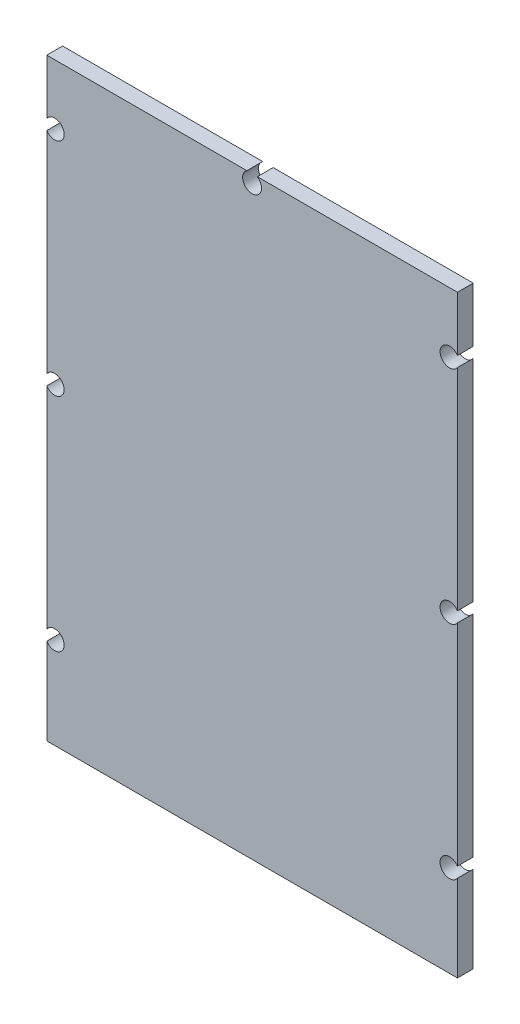
ISO-10303-21;
HEADER;
FILE_DESCRIPTION(('STEP AP214'),'2;1');
FILE_NAME('part.step','',(''),(''),'','','');
FILE_SCHEMA(('AUTOMOTIVE_DESIGN { 1 0 10303 214 1 1 1 1 }'));
ENDSEC;
DATA;
#1=APPLICATION_CONTEXT('core data for automotive mechanical design processes');
#2=APPLICATION_PROTOCOL_DEFINITION('international standard','automotive_design',2000,#1);
#3=PRODUCT_CONTEXT('',#1,'mechanical');
#4=PRODUCT('Part','Part','',(#3));
#5=PRODUCT_RELATED_PRODUCT_CATEGORY('part','',(#4));
#6=PRODUCT_DEFINITION_FORMATION('','',#4);
#7=PRODUCT_DEFINITION_CONTEXT('part definition',#1,'design');
#8=PRODUCT_DEFINITION('design','',#6,#7);
#9=PRODUCT_DEFINITION_SHAPE('','',#8);
#10=(LENGTH_UNIT() NAMED_UNIT(*) SI_UNIT(.MILLI.,.METRE.));
#11=(NAMED_UNIT(*) PLANE_ANGLE_UNIT() SI_UNIT($,.RADIAN.));
#12=(NAMED_UNIT(*) SI_UNIT($,.STERADIAN.) SOLID_ANGLE_UNIT());
#13=UNCERTAINTY_MEASURE_WITH_UNIT(LENGTH_MEASURE(1.E-05),#10,'distance_accuracy_value','');
#14=(GEOMETRIC_REPRESENTATION_CONTEXT(3) GLOBAL_UNCERTAINTY_ASSIGNED_CONTEXT((#13)) GLOBAL_UNIT_ASSIGNED_CONTEXT((#10,
#11,#12)) REPRESENTATION_CONTEXT('',''));
#15=CARTESIAN_POINT('',(0.,0.,0.));
#16=DIRECTION('',(0.,0.,1.));
#17=DIRECTION('',(1.,0.,0.));
#18=AXIS2_PLACEMENT_3D('',#15,#16,#17);
#19=CARTESIAN_POINT('',(-32.5,47.,2.5));
#20=DIRECTION('',(0.,-1.,0.));
#21=DIRECTION('',(0.,0.,-1.));
#22=AXIS2_PLACEMENT_3D('',#19,#20,#21);
#23=PLANE('',#22);
#24=DIRECTION('',(0.,0.,-1.));
#25=VECTOR('',#24,1.);
#26=CARTESIAN_POINT('',(-0.82915619758885,47.,2.5));
#27=LINE('',#26,#25);
#28=CARTESIAN_POINT('',(-0.82915619758885,47.,0.));
#29=VERTEX_POINT('',#28);
#30=CARTESIAN_POINT('',(-0.82915619758885,47.,2.5));
#31=VERTEX_POINT('',#30);
#32=EDGE_CURVE('E160',#29,#31,#27,.F.);
#33=ORIENTED_EDGE('',*,*,#32,.F.);
#34=DIRECTION('',(-1.,0.,0.));
#35=VECTOR('',#34,1.);
#36=CARTESIAN_POINT('',(-32.5,47.,0.));
#37=LINE('',#36,#35);
#38=CARTESIAN_POINT('',(-32.5,47.,0.));
#39=VERTEX_POINT('',#38);
#40=EDGE_CURVE('E200',#29,#39,#37,.T.);
#41=ORIENTED_EDGE('',*,*,#40,.T.);
#42=DIRECTION('',(0.,0.,-1.));
#43=VECTOR('',#42,1.);
#44=CARTESIAN_POINT('',(-32.5,47.,2.5));
#45=LINE('',#44,#43);
#46=CARTESIAN_POINT('',(-32.5,47.,2.5));
#47=VERTEX_POINT('',#46);
#48=EDGE_CURVE('E179',#47,#39,#45,.T.);
#49=ORIENTED_EDGE('',*,*,#48,.F.);
#50=DIRECTION('',(-1.,0.,0.));
#51=VECTOR('',#50,1.);
#52=CARTESIAN_POINT('',(-32.5,47.,2.5));
#53=LINE('',#52,#51);
#54=EDGE_CURVE('E180',#31,#47,#53,.T.);
#55=ORIENTED_EDGE('',*,*,#54,.F.);
#56=EDGE_LOOP('',(#33,#41,#49,#55));
#57=FACE_BOUND('',#56,.T.);
#58=ADVANCED_FACE('F35',(#57),#23,.F.);
#59=DIRECTION('',(0.,0.,-1.));
#60=VECTOR('',#59,1.);
#61=CARTESIAN_POINT('',(0.82915619758885,47.,2.5));
#62=LINE('',#61,#60);
#63=CARTESIAN_POINT('',(0.82915619758885,47.,2.5));
#64=VERTEX_POINT('',#63);
#65=CARTESIAN_POINT('',(0.82915619758885,47.,0.));
#66=VERTEX_POINT('',#65);
#67=EDGE_CURVE('E49',#64,#66,#62,.T.);
#68=ORIENTED_EDGE('',*,*,#67,.F.);
#69=CARTESIAN_POINT('',(32.5,47.,2.5));
#70=VERTEX_POINT('',#69);
#71=EDGE_CURVE('E170',#70,#64,#53,.T.);
#72=ORIENTED_EDGE('',*,*,#71,.F.);
#73=DIRECTION('',(0.,0.,-1.));
#74=VECTOR('',#73,1.);
#75=CARTESIAN_POINT('',(32.5,47.,2.5));
#76=LINE('',#75,#74);
#77=CARTESIAN_POINT('',(32.5,47.,0.));
#78=VERTEX_POINT('',#77);
#79=EDGE_CURVE('E183',#70,#78,#76,.T.);
#80=ORIENTED_EDGE('',*,*,#79,.T.);
#81=EDGE_CURVE('E172',#78,#66,#37,.T.);
#82=ORIENTED_EDGE('',*,*,#81,.T.);
#83=EDGE_LOOP('',(#68,#72,#80,#82));
#84=FACE_BOUND('',#83,.T.);
#85=ADVANCED_FACE('F168',(#84),#23,.F.);
#86=CARTESIAN_POINT('',(-32.5,47.,2.5));
#87=DIRECTION('',(1.,0.,0.));
#88=DIRECTION('',(0.,1.,0.));
#89=AXIS2_PLACEMENT_3D('',#86,#87,#88);
#90=PLANE('',#89);
#91=DIRECTION('',(0.,0.,-1.));
#92=VECTOR('',#91,1.);
#93=CARTESIAN_POINT('',(-32.5,-33.3291561975889,2.5));
#94=LINE('',#93,#92);
#95=CARTESIAN_POINT('',(-32.5,-33.3291561975889,0.));
#96=VERTEX_POINT('',#95);
#97=CARTESIAN_POINT('',(-32.5,-33.3291561975889,2.5));
#98=VERTEX_POINT('',#97);
#99=EDGE_CURVE('E271',#96,#98,#94,.F.);
#100=ORIENTED_EDGE('',*,*,#99,.F.);
#101=DIRECTION('',(0.,-1.,0.));
#102=VECTOR('',#101,1.);
#103=CARTESIAN_POINT('',(-32.5,47.,0.));
#104=LINE('',#103,#102);
#105=CARTESIAN_POINT('',(-32.5,-47.,0.));
#106=VERTEX_POINT('',#105);
#107=EDGE_CURVE('E194',#96,#106,#104,.T.);
#108=ORIENTED_EDGE('',*,*,#107,.T.);
#109=DIRECTION('',(0.,0.,-1.));
#110=VECTOR('',#109,1.);
#111=CARTESIAN_POINT('',(-32.5,-47.,2.5));
#112=LINE('',#111,#110);
#113=CARTESIAN_POINT('',(-32.5,-47.,2.5));
#114=VERTEX_POINT('',#113);
#115=EDGE_CURVE('E209',#114,#106,#112,.T.);
#116=ORIENTED_EDGE('',*,*,#115,.F.);
#117=DIRECTION('',(0.,-1.,0.));
#118=VECTOR('',#117,1.);
#119=CARTESIAN_POINT('',(-32.5,47.,2.5));
#120=LINE('',#119,#118);
#121=EDGE_CURVE('E203',#98,#114,#120,.T.);
#122=ORIENTED_EDGE('',*,*,#121,.F.);
#123=EDGE_LOOP('',(#100,#108,#116,#122));
#124=FACE_BOUND('',#123,.T.);
#125=ADVANCED_FACE('F37',(#124),#90,.F.);
#126=DIRECTION('',(0.,0.,-1.));
#127=VECTOR('',#126,1.);
#128=CARTESIAN_POINT('',(-32.5,-31.6708438024111,2.5));
#129=LINE('',#128,#127);
#130=CARTESIAN_POINT('',(-32.5,-31.6708438024111,2.5));
#131=VERTEX_POINT('',#130);
#132=CARTESIAN_POINT('',(-32.5,-31.6708438024111,0.));
#133=VERTEX_POINT('',#132);
#134=EDGE_CURVE('E57',#131,#133,#129,.T.);
#135=ORIENTED_EDGE('',*,*,#134,.F.);
#136=CARTESIAN_POINT('',(-32.5,1.67084380241114,2.5));
#137=VERTEX_POINT('',#136);
#138=EDGE_CURVE('E334',#137,#131,#120,.T.);
#139=ORIENTED_EDGE('',*,*,#138,.F.);
#140=DIRECTION('',(0.,0.,-1.));
#141=VECTOR('',#140,1.);
#142=CARTESIAN_POINT('',(-32.5,1.67084380241115,2.5));
#143=LINE('',#142,#141);
#144=CARTESIAN_POINT('',(-32.5,1.67084380241114,0.));
#145=VERTEX_POINT('',#144);
#146=EDGE_CURVE('E264',#145,#137,#143,.F.);
#147=ORIENTED_EDGE('',*,*,#146,.F.);
#148=EDGE_CURVE('E315',#145,#133,#104,.T.);
#149=ORIENTED_EDGE('',*,*,#148,.T.);
#150=EDGE_LOOP('',(#135,#139,#147,#149));
#151=FACE_BOUND('',#150,.T.);
#152=ADVANCED_FACE('F332',(#151),#90,.F.);
#153=DIRECTION('',(0.,0.,-1.));
#154=VECTOR('',#153,1.);
#155=CARTESIAN_POINT('',(-32.5,3.32915619758885,2.5));
#156=LINE('',#155,#154);
#157=CARTESIAN_POINT('',(-32.5,3.32915619758885,2.5));
#158=VERTEX_POINT('',#157);
#159=CARTESIAN_POINT('',(-32.5,3.32915619758885,0.));
#160=VERTEX_POINT('',#159);
#161=EDGE_CURVE('E262',#158,#160,#156,.T.);
#162=ORIENTED_EDGE('',*,*,#161,.F.);
#163=CARTESIAN_POINT('',(-32.5,36.6708438024111,2.5));
#164=VERTEX_POINT('',#163);
#165=EDGE_CURVE('E288',#164,#158,#120,.T.);
#166=ORIENTED_EDGE('',*,*,#165,.F.);
#167=DIRECTION('',(0.,0.,-1.));
#168=VECTOR('',#167,1.);
#169=CARTESIAN_POINT('',(-32.5,36.6708438024111,2.5));
#170=LINE('',#169,#168);
#171=CARTESIAN_POINT('',(-32.5,36.6708438024111,0.));
#172=VERTEX_POINT('',#171);
#173=EDGE_CURVE('E283',#172,#164,#170,.F.);
#174=ORIENTED_EDGE('',*,*,#173,.F.);
#175=EDGE_CURVE('E193',#172,#160,#104,.T.);
#176=ORIENTED_EDGE('',*,*,#175,.T.);
#177=EDGE_LOOP('',(#162,#166,#174,#176));
#178=FACE_BOUND('',#177,.T.);
#179=ADVANCED_FACE('F323',(#178),#90,.F.);
#180=CARTESIAN_POINT('',(32.5,47.,2.5));
#181=DIRECTION('',(-1.,0.,0.));
#182=DIRECTION('',(0.,0.,1.));
#183=AXIS2_PLACEMENT_3D('',#180,#181,#182);
#184=PLANE('',#183);
#185=DIRECTION('',(0.,0.,-1.));
#186=VECTOR('',#185,1.);
#187=CARTESIAN_POINT('',(32.5,3.32915619758886,2.5));
#188=LINE('',#187,#186);
#189=CARTESIAN_POINT('',(32.5,3.32915619758886,0.));
#190=VERTEX_POINT('',#189);
#191=CARTESIAN_POINT('',(32.5,3.32915619758886,2.5));
#192=VERTEX_POINT('',#191);
#193=EDGE_CURVE('E225',#190,#192,#188,.F.);
#194=ORIENTED_EDGE('',*,*,#193,.F.);
#195=DIRECTION('',(0.,1.,0.));
#196=VECTOR('',#195,1.);
#197=CARTESIAN_POINT('',(32.5,47.,0.));
#198=LINE('',#197,#196);
#199=CARTESIAN_POINT('',(32.5,36.6708438024112,0.));
#200=VERTEX_POINT('',#199);
#201=EDGE_CURVE('E202',#190,#200,#198,.T.);
#202=ORIENTED_EDGE('',*,*,#201,.T.);
#203=DIRECTION('',(0.,0.,-1.));
#204=VECTOR('',#203,1.);
#205=CARTESIAN_POINT('',(32.5,36.6708438024112,2.5));
#206=LINE('',#205,#204);
#207=CARTESIAN_POINT('',(32.5,36.6708438024112,2.5));
#208=VERTEX_POINT('',#207);
#209=EDGE_CURVE('E276',#208,#200,#206,.T.);
#210=ORIENTED_EDGE('',*,*,#209,.F.);
#211=DIRECTION('',(0.,1.,0.));
#212=VECTOR('',#211,1.);
#213=CARTESIAN_POINT('',(32.5,47.,2.5));
#214=LINE('',#213,#212);
#215=EDGE_CURVE('E238',#192,#208,#214,.T.);
#216=ORIENTED_EDGE('',*,*,#215,.F.);
#217=EDGE_LOOP('',(#194,#202,#210,#216));
#218=FACE_BOUND('',#217,.T.);
#219=ADVANCED_FACE('F235',(#218),#184,.F.);
#220=DIRECTION('',(0.,0.,-1.));
#221=VECTOR('',#220,1.);
#222=CARTESIAN_POINT('',(32.5,1.67084380241115,2.5));
#223=LINE('',#222,#221);
#224=CARTESIAN_POINT('',(32.5,1.67084380241115,2.5));
#225=VERTEX_POINT('',#224);
#226=CARTESIAN_POINT('',(32.5,1.67084380241115,0.));
#227=VERTEX_POINT('',#226);
#228=EDGE_CURVE('E228',#225,#227,#223,.T.);
#229=ORIENTED_EDGE('',*,*,#228,.F.);
#230=CARTESIAN_POINT('',(32.5,-31.6708438024111,2.5));
#231=VERTEX_POINT('',#230);
#232=EDGE_CURVE('E292',#231,#225,#214,.T.);
#233=ORIENTED_EDGE('',*,*,#232,.F.);
#234=DIRECTION('',(0.,0.,-1.));
#235=VECTOR('',#234,1.);
#236=CARTESIAN_POINT('',(32.5,-31.6708438024111,2.5));
#237=LINE('',#236,#235);
#238=CARTESIAN_POINT('',(32.5,-31.6708438024111,0.));
#239=VERTEX_POINT('',#238);
#240=EDGE_CURVE('E268',#239,#231,#237,.F.);
#241=ORIENTED_EDGE('',*,*,#240,.F.);
#242=EDGE_CURVE('E201',#239,#227,#198,.T.);
#243=ORIENTED_EDGE('',*,*,#242,.T.);
#244=EDGE_LOOP('',(#229,#233,#241,#243));
#245=FACE_BOUND('',#244,.T.);
#246=ADVANCED_FACE('F298',(#245),#184,.F.);
#247=DIRECTION('',(0.,0.,-1.));
#248=VECTOR('',#247,1.);
#249=CARTESIAN_POINT('',(32.5,-33.3291561975889,2.5));
#250=LINE('',#249,#248);
#251=CARTESIAN_POINT('',(32.5,-33.3291561975889,2.5));
#252=VERTEX_POINT('',#251);
#253=CARTESIAN_POINT('',(32.5,-33.3291561975889,0.));
#254=VERTEX_POINT('',#253);
#255=EDGE_CURVE('E266',#252,#254,#250,.T.);
#256=ORIENTED_EDGE('',*,*,#255,.F.);
#257=CARTESIAN_POINT('',(32.5,-47.,2.5));
#258=VERTEX_POINT('',#257);
#259=EDGE_CURVE('E185',#258,#252,#214,.T.);
#260=ORIENTED_EDGE('',*,*,#259,.F.);
#261=DIRECTION('',(0.,0.,-1.));
#262=VECTOR('',#261,1.);
#263=CARTESIAN_POINT('',(32.5,-47.,2.5));
#264=LINE('',#263,#262);
#265=CARTESIAN_POINT('',(32.5,-47.,0.));
#266=VERTEX_POINT('',#265);
#267=EDGE_CURVE('E206',#258,#266,#264,.T.);
#268=ORIENTED_EDGE('',*,*,#267,.T.);
#269=EDGE_CURVE('E197',#266,#254,#198,.T.);
#270=ORIENTED_EDGE('',*,*,#269,.T.);
#271=EDGE_LOOP('',(#256,#260,#268,#270));
#272=FACE_BOUND('',#271,.T.);
#273=ADVANCED_FACE('F305',(#272),#184,.F.);
#274=DIRECTION('',(0.,0.,-1.));
#275=VECTOR('',#274,1.);
#276=CARTESIAN_POINT('',(-32.5,38.3291561975889,2.5));
#277=LINE('',#276,#275);
#278=CARTESIAN_POINT('',(-32.5,38.3291561975889,2.5));
#279=VERTEX_POINT('',#278);
#280=CARTESIAN_POINT('',(-32.5,38.3291561975889,0.));
#281=VERTEX_POINT('',#280);
#282=EDGE_CURVE('E281',#279,#281,#277,.T.);
#283=ORIENTED_EDGE('',*,*,#282,.F.);
#284=EDGE_CURVE('E285',#47,#279,#120,.T.);
#285=ORIENTED_EDGE('',*,*,#284,.F.);
#286=ORIENTED_EDGE('',*,*,#48,.T.);
#287=EDGE_CURVE('E189',#39,#281,#104,.T.);
#288=ORIENTED_EDGE('',*,*,#287,.T.);
#289=EDGE_LOOP('',(#283,#285,#286,#288));
#290=FACE_BOUND('',#289,.T.);
#291=ADVANCED_FACE('F358',(#290),#90,.F.);
#292=DIRECTION('',(0.,0.,-1.));
#293=VECTOR('',#292,1.);
#294=CARTESIAN_POINT('',(32.5,38.3291561975889,2.5));
#295=LINE('',#294,#293);
#296=CARTESIAN_POINT('',(32.5,38.3291561975889,0.));
#297=VERTEX_POINT('',#296);
#298=CARTESIAN_POINT('',(32.5,38.3291561975889,2.5));
#299=VERTEX_POINT('',#298);
#300=EDGE_CURVE('E247',#297,#299,#295,.F.);
#301=ORIENTED_EDGE('',*,*,#300,.F.);
#302=EDGE_CURVE('E196',#297,#78,#198,.T.);
#303=ORIENTED_EDGE('',*,*,#302,.T.);
#304=ORIENTED_EDGE('',*,*,#79,.F.);
#305=EDGE_CURVE('E177',#299,#70,#214,.T.);
#306=ORIENTED_EDGE('',*,*,#305,.F.);
#307=EDGE_LOOP('',(#301,#303,#304,#306));
#308=FACE_BOUND('',#307,.T.);
#309=ADVANCED_FACE('F246',(#308),#184,.F.);
#310=CARTESIAN_POINT('',(-32.5,-47.,2.5));
#311=DIRECTION('',(0.,1.,0.));
#312=DIRECTION('',(0.,0.,1.));
#313=AXIS2_PLACEMENT_3D('',#310,#311,#312);
#314=PLANE('',#313);
#315=DIRECTION('',(1.,0.,0.));
#316=VECTOR('',#315,1.);
#317=CARTESIAN_POINT('',(-32.5,-47.,0.));
#318=LINE('',#317,#316);
#319=EDGE_CURVE('E192',#106,#266,#318,.T.);
#320=ORIENTED_EDGE('',*,*,#319,.T.);
#321=ORIENTED_EDGE('',*,*,#267,.F.);
#322=DIRECTION('',(1.,0.,0.));
#323=VECTOR('',#322,1.);
#324=CARTESIAN_POINT('',(-32.5,-47.,2.5));
#325=LINE('',#324,#323);
#326=EDGE_CURVE('E287',#114,#258,#325,.T.);
#327=ORIENTED_EDGE('',*,*,#326,.F.);
#328=ORIENTED_EDGE('',*,*,#115,.T.);
#329=EDGE_LOOP('',(#320,#321,#327,#328));
#330=FACE_BOUND('',#329,.T.);
#331=ADVANCED_FACE('F308',(#330),#314,.F.);
#332=CARTESIAN_POINT('',(0.,0.,2.5));
#333=DIRECTION('',(0.,0.,1.));
#334=DIRECTION('',(1.,0.,0.));
#335=AXIS2_PLACEMENT_3D('',#332,#333,#334);
#336=PLANE('',#335);
#337=ORIENTED_EDGE('',*,*,#71,.T.);
#338=CARTESIAN_POINT('',(0.,45.75,2.5));
#339=DIRECTION('',(0.,0.,1.));
#340=DIRECTION('',(1.,0.,0.));
#341=AXIS2_PLACEMENT_3D('',#338,#339,#340);
#342=CIRCLE('',#341,1.5);
#343=EDGE_CURVE('E157',#31,#64,#342,.T.);
#344=ORIENTED_EDGE('',*,*,#343,.F.);
#345=ORIENTED_EDGE('',*,*,#54,.T.);
#346=ORIENTED_EDGE('',*,*,#284,.T.);
#347=CARTESIAN_POINT('',(-31.25,37.5,2.5));
#348=DIRECTION('',(0.,0.,1.));
#349=DIRECTION('',(1.,0.,0.));
#350=AXIS2_PLACEMENT_3D('',#347,#348,#349);
#351=CIRCLE('',#350,1.5);
#352=EDGE_CURVE('E274',#164,#279,#351,.T.);
#353=ORIENTED_EDGE('',*,*,#352,.F.);
#354=ORIENTED_EDGE('',*,*,#165,.T.);
#355=CARTESIAN_POINT('',(-31.25,2.5,2.5));
#356=DIRECTION('',(0.,0.,1.));
#357=DIRECTION('',(1.,0.,0.));
#358=AXIS2_PLACEMENT_3D('',#355,#356,#357);
#359=CIRCLE('',#358,1.5);
#360=EDGE_CURVE('E259',#137,#158,#359,.T.);
#361=ORIENTED_EDGE('',*,*,#360,.F.);
#362=ORIENTED_EDGE('',*,*,#138,.T.);
#363=CARTESIAN_POINT('',(-31.25,-32.5,2.5));
#364=DIRECTION('',(0.,0.,1.));
#365=DIRECTION('',(1.,0.,0.));
#366=AXIS2_PLACEMENT_3D('',#363,#364,#365);
#367=CIRCLE('',#366,1.5);
#368=EDGE_CURVE('E254',#98,#131,#367,.T.);
#369=ORIENTED_EDGE('',*,*,#368,.F.);
#370=ORIENTED_EDGE('',*,*,#121,.T.);
#371=ORIENTED_EDGE('',*,*,#326,.T.);
#372=ORIENTED_EDGE('',*,*,#259,.T.);
#373=CARTESIAN_POINT('',(31.25,-32.5,2.5));
#374=DIRECTION('',(0.,0.,1.));
#375=DIRECTION('',(-1.,0.,0.));
#376=AXIS2_PLACEMENT_3D('',#373,#374,#375);
#377=CIRCLE('',#376,1.5);
#378=EDGE_CURVE('E252',#231,#252,#377,.T.);
#379=ORIENTED_EDGE('',*,*,#378,.F.);
#380=ORIENTED_EDGE('',*,*,#232,.T.);
#381=CARTESIAN_POINT('',(31.25,2.5,2.5));
#382=DIRECTION('',(0.,0.,1.));
#383=DIRECTION('',(-1.,0.,0.));
#384=AXIS2_PLACEMENT_3D('',#381,#382,#383);
#385=CIRCLE('',#384,1.5);
#386=EDGE_CURVE('E257',#192,#225,#385,.T.);
#387=ORIENTED_EDGE('',*,*,#386,.F.);
#388=ORIENTED_EDGE('',*,*,#215,.T.);
#389=CARTESIAN_POINT('',(31.25,37.5,2.5));
#390=DIRECTION('',(0.,0.,1.));
#391=DIRECTION('',(-1.,0.,0.));
#392=AXIS2_PLACEMENT_3D('',#389,#390,#391);
#393=CIRCLE('',#392,1.5);
#394=EDGE_CURVE('E239',#299,#208,#393,.T.);
#395=ORIENTED_EDGE('',*,*,#394,.F.);
#396=ORIENTED_EDGE('',*,*,#305,.T.);
#397=EDGE_LOOP('',(#337,#344,#345,#346,#353,#354,#361,#362,#369,#370,#371,#372,#379,#380,#387,
#388,#395,#396));
#398=FACE_BOUND('',#397,.T.);
#399=ADVANCED_FACE('F174',(#398),#336,.T.);
#400=CARTESIAN_POINT('',(0.,0.,0.));
#401=DIRECTION('',(0.,0.,1.));
#402=DIRECTION('',(1.,0.,0.));
#403=AXIS2_PLACEMENT_3D('',#400,#401,#402);
#404=PLANE('',#403);
#405=CARTESIAN_POINT('',(0.,45.75,0.));
#406=DIRECTION('',(0.,0.,1.));
#407=DIRECTION('',(1.,0.,0.));
#408=AXIS2_PLACEMENT_3D('',#405,#406,#407);
#409=CIRCLE('',#408,1.5);
#410=EDGE_CURVE('E11',#66,#29,#409,.F.);
#411=ORIENTED_EDGE('',*,*,#410,.F.);
#412=ORIENTED_EDGE('',*,*,#81,.F.);
#413=ORIENTED_EDGE('',*,*,#302,.F.);
#414=CARTESIAN_POINT('',(31.25,37.5,0.));
#415=DIRECTION('',(0.,0.,1.));
#416=DIRECTION('',(1.,0.,0.));
#417=AXIS2_PLACEMENT_3D('',#414,#415,#416);
#418=CIRCLE('',#417,1.5);
#419=EDGE_CURVE('E212',#200,#297,#418,.F.);
#420=ORIENTED_EDGE('',*,*,#419,.F.);
#421=ORIENTED_EDGE('',*,*,#201,.F.);
#422=CARTESIAN_POINT('',(31.25,2.5,0.));
#423=DIRECTION('',(0.,0.,1.));
#424=DIRECTION('',(1.,0.,0.));
#425=AXIS2_PLACEMENT_3D('',#422,#423,#424);
#426=CIRCLE('',#425,1.5);
#427=EDGE_CURVE('E43',#227,#190,#426,.F.);
#428=ORIENTED_EDGE('',*,*,#427,.F.);
#429=ORIENTED_EDGE('',*,*,#242,.F.);
#430=CARTESIAN_POINT('',(31.25,-32.5,0.));
#431=DIRECTION('',(0.,0.,1.));
#432=DIRECTION('',(1.,0.,0.));
#433=AXIS2_PLACEMENT_3D('',#430,#431,#432);
#434=CIRCLE('',#433,1.5);
#435=EDGE_CURVE('E218',#254,#239,#434,.F.);
#436=ORIENTED_EDGE('',*,*,#435,.F.);
#437=ORIENTED_EDGE('',*,*,#269,.F.);
#438=ORIENTED_EDGE('',*,*,#319,.F.);
#439=ORIENTED_EDGE('',*,*,#107,.F.);
#440=CARTESIAN_POINT('',(-31.25,-32.5,0.));
#441=DIRECTION('',(0.,0.,1.));
#442=DIRECTION('',(1.,0.,0.));
#443=AXIS2_PLACEMENT_3D('',#440,#441,#442);
#444=CIRCLE('',#443,1.5);
#445=EDGE_CURVE('E220',#133,#96,#444,.F.);
#446=ORIENTED_EDGE('',*,*,#445,.F.);
#447=ORIENTED_EDGE('',*,*,#148,.F.);
#448=CARTESIAN_POINT('',(-31.25,2.5,0.));
#449=DIRECTION('',(0.,0.,1.));
#450=DIRECTION('',(1.,0.,0.));
#451=AXIS2_PLACEMENT_3D('',#448,#449,#450);
#452=CIRCLE('',#451,1.5);
#453=EDGE_CURVE('E216',#160,#145,#452,.F.);
#454=ORIENTED_EDGE('',*,*,#453,.F.);
#455=ORIENTED_EDGE('',*,*,#175,.F.);
#456=CARTESIAN_POINT('',(-31.25,37.5,0.));
#457=DIRECTION('',(0.,0.,1.));
#458=DIRECTION('',(1.,0.,0.));
#459=AXIS2_PLACEMENT_3D('',#456,#457,#458);
#460=CIRCLE('',#459,1.5);
#461=EDGE_CURVE('E214',#281,#172,#460,.F.);
#462=ORIENTED_EDGE('',*,*,#461,.F.);
#463=ORIENTED_EDGE('',*,*,#287,.F.);
#464=ORIENTED_EDGE('',*,*,#40,.F.);
#465=EDGE_LOOP('',(#411,#412,#413,#420,#421,#428,#429,#436,#437,#438,#439,#446,#447,#454,#455,
#462,#463,#464));
#466=FACE_BOUND('',#465,.T.);
#467=ADVANCED_FACE('F242',(#466),#404,.F.);
#468=CARTESIAN_POINT('',(31.25,37.5,2.5));
#469=DIRECTION('',(0.,0.,-1.));
#470=DIRECTION('',(-1.,0.,0.));
#471=AXIS2_PLACEMENT_3D('',#468,#469,#470);
#472=CYLINDRICAL_SURFACE('',#471,1.5);
#473=ORIENTED_EDGE('',*,*,#300,.T.);
#474=ORIENTED_EDGE('',*,*,#394,.T.);
#475=ORIENTED_EDGE('',*,*,#209,.T.);
#476=ORIENTED_EDGE('',*,*,#419,.T.);
#477=EDGE_LOOP('',(#473,#474,#475,#476));
#478=FACE_BOUND('',#477,.T.);
#479=ADVANCED_FACE('F366',(#478),#472,.F.);
#480=CARTESIAN_POINT('',(-31.25,37.5,2.5));
#481=DIRECTION('',(0.,0.,-1.));
#482=DIRECTION('',(-1.,0.,0.));
#483=AXIS2_PLACEMENT_3D('',#480,#481,#482);
#484=CYLINDRICAL_SURFACE('',#483,1.5);
#485=ORIENTED_EDGE('',*,*,#173,.T.);
#486=ORIENTED_EDGE('',*,*,#352,.T.);
#487=ORIENTED_EDGE('',*,*,#282,.T.);
#488=ORIENTED_EDGE('',*,*,#461,.T.);
#489=EDGE_LOOP('',(#485,#486,#487,#488));
#490=FACE_BOUND('',#489,.T.);
#491=ADVANCED_FACE('F370',(#490),#484,.F.);
#492=CARTESIAN_POINT('',(-31.25,2.5,2.5));
#493=DIRECTION('',(0.,0.,-1.));
#494=DIRECTION('',(-1.,0.,0.));
#495=AXIS2_PLACEMENT_3D('',#492,#493,#494);
#496=CYLINDRICAL_SURFACE('',#495,1.5);
#497=ORIENTED_EDGE('',*,*,#146,.T.);
#498=ORIENTED_EDGE('',*,*,#360,.T.);
#499=ORIENTED_EDGE('',*,*,#161,.T.);
#500=ORIENTED_EDGE('',*,*,#453,.T.);
#501=EDGE_LOOP('',(#497,#498,#499,#500));
#502=FACE_BOUND('',#501,.T.);
#503=ADVANCED_FACE('F329',(#502),#496,.F.);
#504=CARTESIAN_POINT('',(31.25,-32.5,2.5));
#505=DIRECTION('',(0.,0.,-1.));
#506=DIRECTION('',(-1.,0.,0.));
#507=AXIS2_PLACEMENT_3D('',#504,#505,#506);
#508=CYLINDRICAL_SURFACE('',#507,1.5);
#509=ORIENTED_EDGE('',*,*,#240,.T.);
#510=ORIENTED_EDGE('',*,*,#378,.T.);
#511=ORIENTED_EDGE('',*,*,#255,.T.);
#512=ORIENTED_EDGE('',*,*,#435,.T.);
#513=EDGE_LOOP('',(#509,#510,#511,#512));
#514=FACE_BOUND('',#513,.T.);
#515=ADVANCED_FACE('F339',(#514),#508,.F.);
#516=CARTESIAN_POINT('',(-31.25,-32.5,2.5));
#517=DIRECTION('',(0.,0.,-1.));
#518=DIRECTION('',(-1.,0.,0.));
#519=AXIS2_PLACEMENT_3D('',#516,#517,#518);
#520=CYLINDRICAL_SURFACE('',#519,1.5);
#521=ORIENTED_EDGE('',*,*,#99,.T.);
#522=ORIENTED_EDGE('',*,*,#368,.T.);
#523=ORIENTED_EDGE('',*,*,#134,.T.);
#524=ORIENTED_EDGE('',*,*,#445,.T.);
#525=EDGE_LOOP('',(#521,#522,#523,#524));
#526=FACE_BOUND('',#525,.T.);
#527=ADVANCED_FACE('F337',(#526),#520,.F.);
#528=CARTESIAN_POINT('',(31.25,2.5,2.5));
#529=DIRECTION('',(0.,0.,-1.));
#530=DIRECTION('',(-1.,0.,0.));
#531=AXIS2_PLACEMENT_3D('',#528,#529,#530);
#532=CYLINDRICAL_SURFACE('',#531,1.5);
#533=ORIENTED_EDGE('',*,*,#193,.T.);
#534=ORIENTED_EDGE('',*,*,#386,.T.);
#535=ORIENTED_EDGE('',*,*,#228,.T.);
#536=ORIENTED_EDGE('',*,*,#427,.T.);
#537=EDGE_LOOP('',(#533,#534,#535,#536));
#538=FACE_BOUND('',#537,.T.);
#539=ADVANCED_FACE('F224',(#538),#532,.F.);
#540=CARTESIAN_POINT('',(0.,45.75,2.5));
#541=DIRECTION('',(0.,0.,-1.));
#542=DIRECTION('',(-1.,0.,0.));
#543=AXIS2_PLACEMENT_3D('',#540,#541,#542);
#544=CYLINDRICAL_SURFACE('',#543,1.5);
#545=ORIENTED_EDGE('',*,*,#32,.T.);
#546=ORIENTED_EDGE('',*,*,#343,.T.);
#547=ORIENTED_EDGE('',*,*,#67,.T.);
#548=ORIENTED_EDGE('',*,*,#410,.T.);
#549=EDGE_LOOP('',(#545,#546,#547,#548));
#550=FACE_BOUND('',#549,.T.);
#551=ADVANCED_FACE('F158',(#550),#544,.F.);
#552=CLOSED_SHELL('',(#58,#85,#125,#152,#179,#219,#246,#273,#291,#309,#331,#399,#467,#479,#491,
#503,#515,#527,#539,#551));
#553=MANIFOLD_SOLID_BREP('B2',#552);
#554=ADVANCED_BREP_SHAPE_REPRESENTATION('',(#18,#553),#14);
#555=SHAPE_DEFINITION_REPRESENTATION(#9,#554);
ENDSEC;
END-ISO-10303-21;
